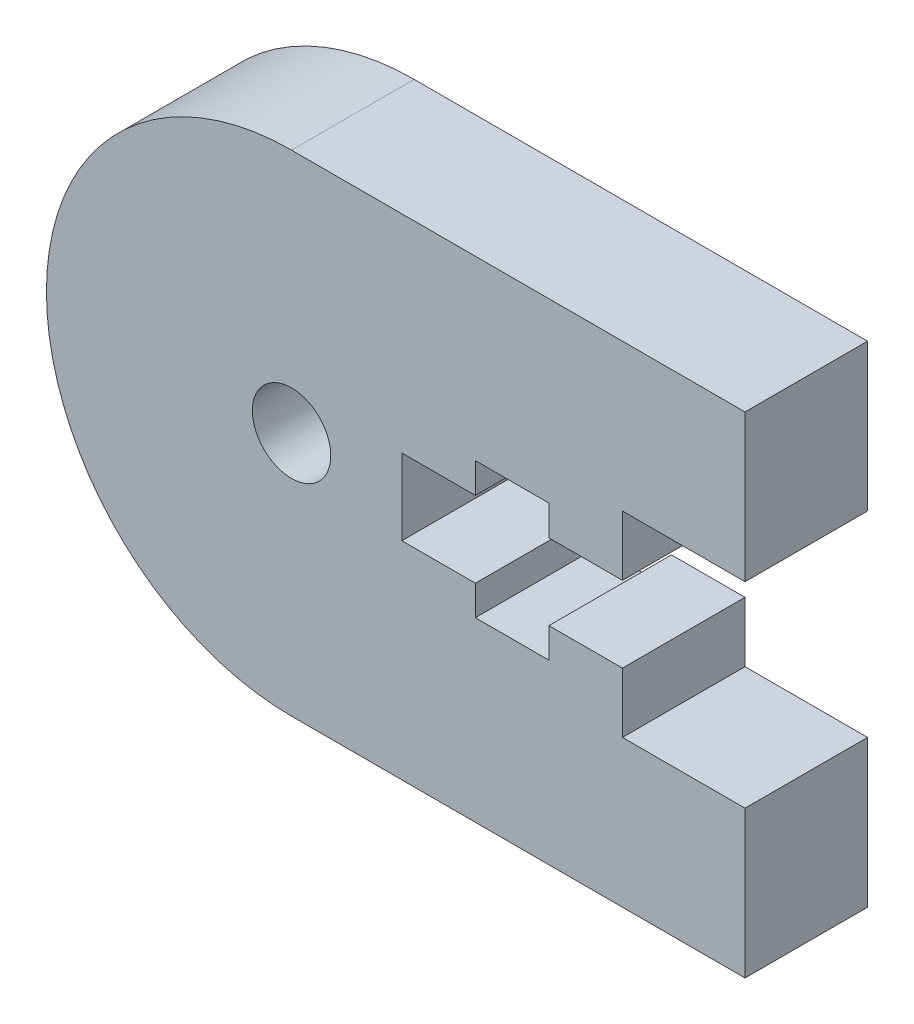
ISO-10303-21;
HEADER;
FILE_DESCRIPTION(('STEP AP214'),'2;1');
FILE_NAME('part.step','',(''),(''),'','','');
FILE_SCHEMA(('AUTOMOTIVE_DESIGN { 1 0 10303 214 1 1 1 1 }'));
ENDSEC;
DATA;
#1=APPLICATION_CONTEXT('core data for automotive mechanical design processes');
#2=APPLICATION_PROTOCOL_DEFINITION('international standard','automotive_design',2000,#1);
#3=PRODUCT_CONTEXT('',#1,'mechanical');
#4=PRODUCT('Part','Part','',(#3));
#5=PRODUCT_RELATED_PRODUCT_CATEGORY('part','',(#4));
#6=PRODUCT_DEFINITION_FORMATION('','',#4);
#7=PRODUCT_DEFINITION_CONTEXT('part definition',#1,'design');
#8=PRODUCT_DEFINITION('design','',#6,#7);
#9=PRODUCT_DEFINITION_SHAPE('','',#8);
#10=(LENGTH_UNIT() NAMED_UNIT(*) SI_UNIT(.MILLI.,.METRE.));
#11=(NAMED_UNIT(*) PLANE_ANGLE_UNIT() SI_UNIT($,.RADIAN.));
#12=(NAMED_UNIT(*) SI_UNIT($,.STERADIAN.) SOLID_ANGLE_UNIT());
#13=UNCERTAINTY_MEASURE_WITH_UNIT(LENGTH_MEASURE(1.E-05),#10,'distance_accuracy_value','');
#14=(GEOMETRIC_REPRESENTATION_CONTEXT(3) GLOBAL_UNCERTAINTY_ASSIGNED_CONTEXT((#13)) GLOBAL_UNIT_ASSIGNED_CONTEXT((#10,
#11,#12)) REPRESENTATION_CONTEXT('',''));
#15=CARTESIAN_POINT('',(0.,0.,0.));
#16=DIRECTION('',(0.,0.,1.));
#17=DIRECTION('',(1.,0.,0.));
#18=AXIS2_PLACEMENT_3D('',#15,#16,#17);
#19=CARTESIAN_POINT('',(12.,4.,0.));
#20=DIRECTION('',(-1.,0.,0.));
#21=DIRECTION('',(0.,0.,1.));
#22=AXIS2_PLACEMENT_3D('',#19,#20,#21);
#23=PLANE('',#22);
#24=DIRECTION('',(0.,0.,1.));
#25=VECTOR('',#24,1.);
#26=CARTESIAN_POINT('',(12.,-1.55,0.));
#27=LINE('',#26,#25);
#28=CARTESIAN_POINT('',(12.,-1.55,0.));
#29=VERTEX_POINT('',#28);
#30=CARTESIAN_POINT('',(12.,-1.55,5.));
#31=VERTEX_POINT('',#30);
#32=EDGE_CURVE('E302',#29,#31,#27,.T.);
#33=ORIENTED_EDGE('',*,*,#32,.T.);
#34=DIRECTION('',(0.,-1.,0.));
#35=VECTOR('',#34,1.);
#36=CARTESIAN_POINT('',(12.,4.,5.));
#37=LINE('',#36,#35);
#38=CARTESIAN_POINT('',(12.,-4.,5.));
#39=VERTEX_POINT('',#38);
#40=EDGE_CURVE('E335',#31,#39,#37,.T.);
#41=ORIENTED_EDGE('',*,*,#40,.T.);
#42=DIRECTION('',(0.,0.,1.));
#43=VECTOR('',#42,1.);
#44=CARTESIAN_POINT('',(12.,-4.,0.));
#45=LINE('',#44,#43);
#46=CARTESIAN_POINT('',(12.,-4.,0.));
#47=VERTEX_POINT('',#46);
#48=EDGE_CURVE('E339',#47,#39,#45,.T.);
#49=ORIENTED_EDGE('',*,*,#48,.F.);
#50=DIRECTION('',(0.,-1.,0.));
#51=VECTOR('',#50,1.);
#52=CARTESIAN_POINT('',(12.,4.,0.));
#53=LINE('',#52,#51);
#54=EDGE_CURVE('E325',#29,#47,#53,.T.);
#55=ORIENTED_EDGE('',*,*,#54,.F.);
#56=EDGE_LOOP('',(#33,#41,#49,#55));
#57=FACE_BOUND('',#56,.T.);
#58=ADVANCED_FACE('F42',(#57),#23,.F.);
#59=CARTESIAN_POINT('',(17.,10.,5.));
#60=DIRECTION('',(1.,0.,0.));
#61=DIRECTION('',(0.,0.,-1.));
#62=AXIS2_PLACEMENT_3D('',#59,#60,#61);
#63=PLANE('',#62);
#64=DIRECTION('',(0.,0.,1.));
#65=VECTOR('',#64,1.);
#66=CARTESIAN_POINT('',(17.,-4.,0.));
#67=LINE('',#66,#65);
#68=CARTESIAN_POINT('',(17.,-4.,0.));
#69=VERTEX_POINT('',#68);
#70=CARTESIAN_POINT('',(17.,-4.,5.));
#71=VERTEX_POINT('',#70);
#72=EDGE_CURVE('E328',#69,#71,#67,.T.);
#73=ORIENTED_EDGE('',*,*,#72,.T.);
#74=DIRECTION('',(0.,-1.,0.));
#75=VECTOR('',#74,1.);
#76=CARTESIAN_POINT('',(17.,10.,5.));
#77=LINE('',#76,#75);
#78=CARTESIAN_POINT('',(17.,-10.,5.));
#79=VERTEX_POINT('',#78);
#80=EDGE_CURVE('E357',#71,#79,#77,.T.);
#81=ORIENTED_EDGE('',*,*,#80,.T.);
#82=DIRECTION('',(0.,0.,-1.));
#83=VECTOR('',#82,1.);
#84=CARTESIAN_POINT('',(17.,-10.,5.));
#85=LINE('',#84,#83);
#86=CARTESIAN_POINT('',(17.,-10.,0.));
#87=VERTEX_POINT('',#86);
#88=EDGE_CURVE('E392',#79,#87,#85,.T.);
#89=ORIENTED_EDGE('',*,*,#88,.T.);
#90=DIRECTION('',(0.,-1.,0.));
#91=VECTOR('',#90,1.);
#92=CARTESIAN_POINT('',(17.,10.,0.));
#93=LINE('',#92,#91);
#94=EDGE_CURVE('E374',#69,#87,#93,.T.);
#95=ORIENTED_EDGE('',*,*,#94,.F.);
#96=EDGE_LOOP('',(#73,#81,#89,#95));
#97=FACE_BOUND('',#96,.T.);
#98=ADVANCED_FACE('F413',(#97),#63,.T.);
#99=CARTESIAN_POINT('',(-1.49999999999999,10.,5.));
#100=DIRECTION('',(0.,1.,0.));
#101=DIRECTION('',(-1.,0.,0.));
#102=AXIS2_PLACEMENT_3D('',#99,#100,#101);
#103=PLANE('',#102);
#104=DIRECTION('',(1.,0.,0.));
#105=VECTOR('',#104,1.);
#106=CARTESIAN_POINT('',(-1.49999999999999,10.,0.));
#107=LINE('',#106,#105);
#108=CARTESIAN_POINT('',(-1.49999999999999,10.,0.));
#109=VERTEX_POINT('',#108);
#110=CARTESIAN_POINT('',(17.,10.,0.));
#111=VERTEX_POINT('',#110);
#112=EDGE_CURVE('E343',#109,#111,#107,.T.);
#113=ORIENTED_EDGE('',*,*,#112,.F.);
#114=DIRECTION('',(0.,0.,-1.));
#115=VECTOR('',#114,1.);
#116=CARTESIAN_POINT('',(-1.49999999999999,10.,5.));
#117=LINE('',#116,#115);
#118=CARTESIAN_POINT('',(-1.49999999999999,10.,5.));
#119=VERTEX_POINT('',#118);
#120=EDGE_CURVE('E385',#119,#109,#117,.T.);
#121=ORIENTED_EDGE('',*,*,#120,.F.);
#122=DIRECTION('',(1.,0.,0.));
#123=VECTOR('',#122,1.);
#124=CARTESIAN_POINT('',(-1.49999999999999,10.,5.));
#125=LINE('',#124,#123);
#126=CARTESIAN_POINT('',(17.,10.,5.));
#127=VERTEX_POINT('',#126);
#128=EDGE_CURVE('E353',#119,#127,#125,.T.);
#129=ORIENTED_EDGE('',*,*,#128,.T.);
#130=DIRECTION('',(0.,0.,-1.));
#131=VECTOR('',#130,1.);
#132=CARTESIAN_POINT('',(17.,10.,5.));
#133=LINE('',#132,#131);
#134=EDGE_CURVE('E370',#127,#111,#133,.T.);
#135=ORIENTED_EDGE('',*,*,#134,.T.);
#136=EDGE_LOOP('',(#113,#121,#129,#135));
#137=FACE_BOUND('',#136,.T.);
#138=ADVANCED_FACE('F420',(#137),#103,.T.);
#139=CARTESIAN_POINT('',(-1.49999999999999,0.,5.));
#140=DIRECTION('',(0.,0.,-1.));
#141=DIRECTION('',(-1.,0.,0.));
#142=AXIS2_PLACEMENT_3D('',#139,#140,#141);
#143=CYLINDRICAL_SURFACE('',#142,10.);
#144=ORIENTED_EDGE('',*,*,#120,.T.);
#145=CARTESIAN_POINT('',(-1.49999999999999,0.,0.));
#146=DIRECTION('',(0.,0.,-1.));
#147=DIRECTION('',(-1.,0.,0.));
#148=AXIS2_PLACEMENT_3D('',#145,#146,#147);
#149=CIRCLE('',#148,10.);
#150=CARTESIAN_POINT('',(-1.5,-10.,0.));
#151=VERTEX_POINT('',#150);
#152=EDGE_CURVE('E358',#151,#109,#149,.T.);
#153=ORIENTED_EDGE('',*,*,#152,.F.);
#154=DIRECTION('',(0.,0.,-1.));
#155=VECTOR('',#154,1.);
#156=CARTESIAN_POINT('',(-1.5,-10.,5.));
#157=LINE('',#156,#155);
#158=CARTESIAN_POINT('',(-1.5,-10.,5.));
#159=VERTEX_POINT('',#158);
#160=EDGE_CURVE('E389',#159,#151,#157,.T.);
#161=ORIENTED_EDGE('',*,*,#160,.F.);
#162=CARTESIAN_POINT('',(-1.49999999999999,0.,5.));
#163=DIRECTION('',(0.,0.,-1.));
#164=DIRECTION('',(-1.,0.,0.));
#165=AXIS2_PLACEMENT_3D('',#162,#163,#164);
#166=CIRCLE('',#165,10.);
#167=EDGE_CURVE('E367',#159,#119,#166,.T.);
#168=ORIENTED_EDGE('',*,*,#167,.T.);
#169=EDGE_LOOP('',(#144,#153,#161,#168));
#170=FACE_BOUND('',#169,.T.);
#171=ADVANCED_FACE('F457',(#170),#143,.T.);
#172=CARTESIAN_POINT('',(17.,-10.,5.));
#173=DIRECTION('',(0.,-1.,0.));
#174=DIRECTION('',(0.,0.,-1.));
#175=AXIS2_PLACEMENT_3D('',#172,#173,#174);
#176=PLANE('',#175);
#177=DIRECTION('',(-1.,0.,0.));
#178=VECTOR('',#177,1.);
#179=CARTESIAN_POINT('',(17.,-10.,0.));
#180=LINE('',#179,#178);
#181=EDGE_CURVE('E379',#87,#151,#180,.T.);
#182=ORIENTED_EDGE('',*,*,#181,.F.);
#183=ORIENTED_EDGE('',*,*,#88,.F.);
#184=DIRECTION('',(-1.,0.,0.));
#185=VECTOR('',#184,1.);
#186=CARTESIAN_POINT('',(17.,-10.,5.));
#187=LINE('',#186,#185);
#188=EDGE_CURVE('E363',#79,#159,#187,.T.);
#189=ORIENTED_EDGE('',*,*,#188,.T.);
#190=ORIENTED_EDGE('',*,*,#160,.T.);
#191=EDGE_LOOP('',(#182,#183,#189,#190));
#192=FACE_BOUND('',#191,.T.);
#193=ADVANCED_FACE('F464',(#192),#176,.T.);
#194=DIRECTION('',(0.,0.,1.));
#195=VECTOR('',#194,1.);
#196=CARTESIAN_POINT('',(17.,4.,0.));
#197=LINE('',#196,#195);
#198=CARTESIAN_POINT('',(17.,4.,0.));
#199=VERTEX_POINT('',#198);
#200=CARTESIAN_POINT('',(17.,4.,5.));
#201=VERTEX_POINT('',#200);
#202=EDGE_CURVE('E347',#199,#201,#197,.T.);
#203=ORIENTED_EDGE('',*,*,#202,.F.);
#204=EDGE_CURVE('E375',#111,#199,#93,.T.);
#205=ORIENTED_EDGE('',*,*,#204,.F.);
#206=ORIENTED_EDGE('',*,*,#134,.F.);
#207=EDGE_CURVE('E359',#127,#201,#77,.T.);
#208=ORIENTED_EDGE('',*,*,#207,.T.);
#209=EDGE_LOOP('',(#203,#205,#206,#208));
#210=FACE_BOUND('',#209,.T.);
#211=ADVANCED_FACE('F423',(#210),#63,.T.);
#212=CARTESIAN_POINT('',(-1.49999999999999,0.,5.));
#213=DIRECTION('',(0.,0.,-1.));
#214=DIRECTION('',(-1.,0.,0.));
#215=AXIS2_PLACEMENT_3D('',#212,#213,#214);
#216=PLANE('',#215);
#217=DIRECTION('',(0.,1.,0.));
#218=VECTOR('',#217,1.);
#219=CARTESIAN_POINT('',(9.,0.,5.));
#220=LINE('',#219,#218);
#221=CARTESIAN_POINT('',(9.,1.55,5.));
#222=VERTEX_POINT('',#221);
#223=CARTESIAN_POINT('',(9.,2.78,5.));
#224=VERTEX_POINT('',#223);
#225=EDGE_CURVE('E265',#222,#224,#220,.T.);
#226=ORIENTED_EDGE('',*,*,#225,.F.);
#227=DIRECTION('',(-1.,0.,0.));
#228=VECTOR('',#227,1.);
#229=CARTESIAN_POINT('',(0.,1.55,5.));
#230=LINE('',#229,#228);
#231=CARTESIAN_POINT('',(12.,1.55,5.));
#232=VERTEX_POINT('',#231);
#233=EDGE_CURVE('E261',#232,#222,#230,.T.);
#234=ORIENTED_EDGE('',*,*,#233,.F.);
#235=CARTESIAN_POINT('',(12.,4.,5.));
#236=VERTEX_POINT('',#235);
#237=EDGE_CURVE('E321',#236,#232,#37,.T.);
#238=ORIENTED_EDGE('',*,*,#237,.F.);
#239=DIRECTION('',(-1.,0.,0.));
#240=VECTOR('',#239,1.);
#241=CARTESIAN_POINT('',(17.,4.,5.));
#242=LINE('',#241,#240);
#243=EDGE_CURVE('E331',#201,#236,#242,.T.);
#244=ORIENTED_EDGE('',*,*,#243,.F.);
#245=ORIENTED_EDGE('',*,*,#207,.F.);
#246=ORIENTED_EDGE('',*,*,#128,.F.);
#247=ORIENTED_EDGE('',*,*,#167,.F.);
#248=ORIENTED_EDGE('',*,*,#188,.F.);
#249=ORIENTED_EDGE('',*,*,#80,.F.);
#250=DIRECTION('',(1.,0.,0.));
#251=VECTOR('',#250,1.);
#252=CARTESIAN_POINT('',(12.,-4.,5.));
#253=LINE('',#252,#251);
#254=EDGE_CURVE('E283',#39,#71,#253,.T.);
#255=ORIENTED_EDGE('',*,*,#254,.F.);
#256=ORIENTED_EDGE('',*,*,#40,.F.);
#257=DIRECTION('',(-1.,0.,0.));
#258=VECTOR('',#257,1.);
#259=CARTESIAN_POINT('',(0.,-1.55,5.));
#260=LINE('',#259,#258);
#261=CARTESIAN_POINT('',(9.,-1.55,5.));
#262=VERTEX_POINT('',#261);
#263=EDGE_CURVE('E58',#31,#262,#260,.T.);
#264=ORIENTED_EDGE('',*,*,#263,.T.);
#265=DIRECTION('',(0.,1.,0.));
#266=VECTOR('',#265,1.);
#267=CARTESIAN_POINT('',(9.,0.,5.));
#268=LINE('',#267,#266);
#269=CARTESIAN_POINT('',(9.,-2.77,5.));
#270=VERTEX_POINT('',#269);
#271=EDGE_CURVE('E255',#270,#262,#268,.T.);
#272=ORIENTED_EDGE('',*,*,#271,.F.);
#273=DIRECTION('',(1.,0.,0.));
#274=VECTOR('',#273,1.);
#275=CARTESIAN_POINT('',(0.,-2.77,5.));
#276=LINE('',#275,#274);
#277=CARTESIAN_POINT('',(6.,-2.77,5.));
#278=VERTEX_POINT('',#277);
#279=EDGE_CURVE('E251',#278,#270,#276,.T.);
#280=ORIENTED_EDGE('',*,*,#279,.F.);
#281=DIRECTION('',(0.,1.,0.));
#282=VECTOR('',#281,1.);
#283=CARTESIAN_POINT('',(6.,0.,5.));
#284=LINE('',#283,#282);
#285=CARTESIAN_POINT('',(6.,-1.55,5.));
#286=VERTEX_POINT('',#285);
#287=EDGE_CURVE('E247',#278,#286,#284,.T.);
#288=ORIENTED_EDGE('',*,*,#287,.T.);
#289=DIRECTION('',(-1.,0.,0.));
#290=VECTOR('',#289,1.);
#291=CARTESIAN_POINT('',(0.,-1.55,5.));
#292=LINE('',#291,#290);
#293=CARTESIAN_POINT('',(3.,-1.55,5.));
#294=VERTEX_POINT('',#293);
#295=EDGE_CURVE('E200',#286,#294,#292,.T.);
#296=ORIENTED_EDGE('',*,*,#295,.T.);
#297=DIRECTION('',(0.,1.,0.));
#298=VECTOR('',#297,1.);
#299=CARTESIAN_POINT('',(3.,0.,5.));
#300=LINE('',#299,#298);
#301=CARTESIAN_POINT('',(3.,1.55,5.));
#302=VERTEX_POINT('',#301);
#303=EDGE_CURVE('E210',#294,#302,#300,.T.);
#304=ORIENTED_EDGE('',*,*,#303,.T.);
#305=DIRECTION('',(-1.,0.,0.));
#306=VECTOR('',#305,1.);
#307=CARTESIAN_POINT('',(0.,1.55,5.));
#308=LINE('',#307,#306);
#309=CARTESIAN_POINT('',(6.,1.55,5.));
#310=VERTEX_POINT('',#309);
#311=EDGE_CURVE('E215',#310,#302,#308,.T.);
#312=ORIENTED_EDGE('',*,*,#311,.F.);
#313=DIRECTION('',(0.,1.,0.));
#314=VECTOR('',#313,1.);
#315=CARTESIAN_POINT('',(6.,0.,5.));
#316=LINE('',#315,#314);
#317=CARTESIAN_POINT('',(6.,2.78,5.));
#318=VERTEX_POINT('',#317);
#319=EDGE_CURVE('E273',#310,#318,#316,.T.);
#320=ORIENTED_EDGE('',*,*,#319,.T.);
#321=DIRECTION('',(1.,0.,0.));
#322=VECTOR('',#321,1.);
#323=CARTESIAN_POINT('',(0.,2.78,5.));
#324=LINE('',#323,#322);
#325=EDGE_CURVE('E269',#318,#224,#324,.T.);
#326=ORIENTED_EDGE('',*,*,#325,.T.);
#327=EDGE_LOOP('',(#226,#234,#238,#244,#245,#246,#247,#248,#249,#255,#256,#264,#272,#280,#288,
#296,#304,#312,#320,#326));
#328=FACE_BOUND('',#327,.T.);
#329=CARTESIAN_POINT('',(-1.49999999999999,0.,5.));
#330=DIRECTION('',(0.,0.,1.));
#331=DIRECTION('',(1.,0.,0.));
#332=AXIS2_PLACEMENT_3D('',#329,#330,#331);
#333=CIRCLE('',#332,1.6);
#334=CARTESIAN_POINT('',(0.100000000000007,0.,5.));
#335=VERTEX_POINT('',#334);
#336=EDGE_CURVE('E248',#335,#335,#333,.T.);
#337=ORIENTED_EDGE('',*,*,#336,.F.);
#338=EDGE_LOOP('',(#337));
#339=FACE_BOUND('',#338,.T.);
#340=ADVANCED_FACE('F440',(#328,#339),#216,.F.);
#341=CARTESIAN_POINT('',(-1.49999999999999,0.,0.));
#342=DIRECTION('',(0.,0.,-1.));
#343=DIRECTION('',(-1.,0.,0.));
#344=AXIS2_PLACEMENT_3D('',#341,#342,#343);
#345=PLANE('',#344);
#346=CARTESIAN_POINT('',(-1.49999999999999,0.,0.));
#347=DIRECTION('',(0.,0.,-1.));
#348=DIRECTION('',(-1.,0.,0.));
#349=AXIS2_PLACEMENT_3D('',#346,#347,#348);
#350=CIRCLE('',#349,3.6);
#351=CARTESIAN_POINT('',(-5.09999999999999,0.,0.));
#352=VERTEX_POINT('',#351);
#353=EDGE_CURVE('E51',#352,#352,#350,.F.);
#354=ORIENTED_EDGE('',*,*,#353,.T.);
#355=EDGE_LOOP('',(#354));
#356=FACE_BOUND('',#355,.T.);
#357=DIRECTION('',(-1.,0.,0.));
#358=VECTOR('',#357,1.);
#359=CARTESIAN_POINT('',(0.,1.55,0.));
#360=LINE('',#359,#358);
#361=CARTESIAN_POINT('',(12.,1.55,0.));
#362=VERTEX_POINT('',#361);
#363=CARTESIAN_POINT('',(9.,1.55,0.));
#364=VERTEX_POINT('',#363);
#365=EDGE_CURVE('E227',#362,#364,#360,.T.);
#366=ORIENTED_EDGE('',*,*,#365,.T.);
#367=DIRECTION('',(0.,1.,0.));
#368=VECTOR('',#367,1.);
#369=CARTESIAN_POINT('',(9.,0.,0.));
#370=LINE('',#369,#368);
#371=CARTESIAN_POINT('',(9.,2.78,0.));
#372=VERTEX_POINT('',#371);
#373=EDGE_CURVE('E230',#364,#372,#370,.T.);
#374=ORIENTED_EDGE('',*,*,#373,.T.);
#375=DIRECTION('',(1.,0.,0.));
#376=VECTOR('',#375,1.);
#377=CARTESIAN_POINT('',(0.,2.78,0.));
#378=LINE('',#377,#376);
#379=CARTESIAN_POINT('',(6.,2.78,0.));
#380=VERTEX_POINT('',#379);
#381=EDGE_CURVE('E234',#380,#372,#378,.T.);
#382=ORIENTED_EDGE('',*,*,#381,.F.);
#383=DIRECTION('',(0.,1.,0.));
#384=VECTOR('',#383,1.);
#385=CARTESIAN_POINT('',(6.,0.,0.));
#386=LINE('',#385,#384);
#387=CARTESIAN_POINT('',(6.,1.55,0.));
#388=VERTEX_POINT('',#387);
#389=EDGE_CURVE('E237',#388,#380,#386,.T.);
#390=ORIENTED_EDGE('',*,*,#389,.F.);
#391=DIRECTION('',(-1.,0.,0.));
#392=VECTOR('',#391,1.);
#393=CARTESIAN_POINT('',(0.,1.55,0.));
#394=LINE('',#393,#392);
#395=CARTESIAN_POINT('',(3.,1.55,0.));
#396=VERTEX_POINT('',#395);
#397=EDGE_CURVE('E240',#388,#396,#394,.T.);
#398=ORIENTED_EDGE('',*,*,#397,.T.);
#399=DIRECTION('',(0.,1.,0.));
#400=VECTOR('',#399,1.);
#401=CARTESIAN_POINT('',(3.,0.,0.));
#402=LINE('',#401,#400);
#403=CARTESIAN_POINT('',(3.,-1.55,0.));
#404=VERTEX_POINT('',#403);
#405=EDGE_CURVE('E203',#404,#396,#402,.T.);
#406=ORIENTED_EDGE('',*,*,#405,.F.);
#407=DIRECTION('',(-1.,0.,0.));
#408=VECTOR('',#407,1.);
#409=CARTESIAN_POINT('',(0.,-1.55,0.));
#410=LINE('',#409,#408);
#411=CARTESIAN_POINT('',(6.,-1.55,0.));
#412=VERTEX_POINT('',#411);
#413=EDGE_CURVE('E193',#412,#404,#410,.T.);
#414=ORIENTED_EDGE('',*,*,#413,.F.);
#415=DIRECTION('',(0.,1.,0.));
#416=VECTOR('',#415,1.);
#417=CARTESIAN_POINT('',(6.,0.,0.));
#418=LINE('',#417,#416);
#419=CARTESIAN_POINT('',(6.,-2.77,0.));
#420=VERTEX_POINT('',#419);
#421=EDGE_CURVE('E180',#420,#412,#418,.T.);
#422=ORIENTED_EDGE('',*,*,#421,.F.);
#423=DIRECTION('',(1.,0.,0.));
#424=VECTOR('',#423,1.);
#425=CARTESIAN_POINT('',(0.,-2.77,0.));
#426=LINE('',#425,#424);
#427=CARTESIAN_POINT('',(9.,-2.77,0.));
#428=VERTEX_POINT('',#427);
#429=EDGE_CURVE('E192',#420,#428,#426,.T.);
#430=ORIENTED_EDGE('',*,*,#429,.T.);
#431=DIRECTION('',(0.,1.,0.));
#432=VECTOR('',#431,1.);
#433=CARTESIAN_POINT('',(9.,0.,0.));
#434=LINE('',#433,#432);
#435=CARTESIAN_POINT('',(9.,-1.55,0.));
#436=VERTEX_POINT('',#435);
#437=EDGE_CURVE('E220',#428,#436,#434,.T.);
#438=ORIENTED_EDGE('',*,*,#437,.T.);
#439=DIRECTION('',(-1.,0.,0.));
#440=VECTOR('',#439,1.);
#441=CARTESIAN_POINT('',(0.,-1.55,0.));
#442=LINE('',#441,#440);
#443=EDGE_CURVE('E224',#29,#436,#442,.T.);
#444=ORIENTED_EDGE('',*,*,#443,.F.);
#445=ORIENTED_EDGE('',*,*,#54,.T.);
#446=DIRECTION('',(1.,0.,0.));
#447=VECTOR('',#446,1.);
#448=CARTESIAN_POINT('',(12.,-4.,0.));
#449=LINE('',#448,#447);
#450=EDGE_CURVE('E316',#47,#69,#449,.T.);
#451=ORIENTED_EDGE('',*,*,#450,.T.);
#452=ORIENTED_EDGE('',*,*,#94,.T.);
#453=ORIENTED_EDGE('',*,*,#181,.T.);
#454=ORIENTED_EDGE('',*,*,#152,.T.);
#455=ORIENTED_EDGE('',*,*,#112,.T.);
#456=ORIENTED_EDGE('',*,*,#204,.T.);
#457=DIRECTION('',(-1.,0.,0.));
#458=VECTOR('',#457,1.);
#459=CARTESIAN_POINT('',(17.,4.,0.));
#460=LINE('',#459,#458);
#461=CARTESIAN_POINT('',(12.,4.,0.));
#462=VERTEX_POINT('',#461);
#463=EDGE_CURVE('E320',#199,#462,#460,.T.);
#464=ORIENTED_EDGE('',*,*,#463,.T.);
#465=EDGE_CURVE('E66',#462,#362,#53,.T.);
#466=ORIENTED_EDGE('',*,*,#465,.T.);
#467=EDGE_LOOP('',(#366,#374,#382,#390,#398,#406,#414,#422,#430,#438,#444,#445,#451,#452,#453,
#454,#455,#456,#464,#466));
#468=FACE_BOUND('',#467,.T.);
#469=ADVANCED_FACE('F207',(#356,#468),#345,.T.);
#470=CARTESIAN_POINT('',(12.,-4.,0.));
#471=DIRECTION('',(0.,-1.,0.));
#472=DIRECTION('',(0.,0.,-1.));
#473=AXIS2_PLACEMENT_3D('',#470,#471,#472);
#474=PLANE('',#473);
#475=ORIENTED_EDGE('',*,*,#254,.T.);
#476=ORIENTED_EDGE('',*,*,#72,.F.);
#477=ORIENTED_EDGE('',*,*,#450,.F.);
#478=ORIENTED_EDGE('',*,*,#48,.T.);
#479=EDGE_LOOP('',(#475,#476,#477,#478));
#480=FACE_BOUND('',#479,.T.);
#481=ADVANCED_FACE('F427',(#480),#474,.F.);
#482=ORIENTED_EDGE('',*,*,#237,.T.);
#483=DIRECTION('',(0.,0.,1.));
#484=VECTOR('',#483,1.);
#485=CARTESIAN_POINT('',(12.,1.55,0.));
#486=LINE('',#485,#484);
#487=EDGE_CURVE('E299',#362,#232,#486,.T.);
#488=ORIENTED_EDGE('',*,*,#487,.F.);
#489=ORIENTED_EDGE('',*,*,#465,.F.);
#490=DIRECTION('',(0.,0.,1.));
#491=VECTOR('',#490,1.);
#492=CARTESIAN_POINT('',(12.,4.,0.));
#493=LINE('',#492,#491);
#494=EDGE_CURVE('E344',#462,#236,#493,.T.);
#495=ORIENTED_EDGE('',*,*,#494,.T.);
#496=EDGE_LOOP('',(#482,#488,#489,#495));
#497=FACE_BOUND('',#496,.T.);
#498=ADVANCED_FACE('F416',(#497),#23,.F.);
#499=CARTESIAN_POINT('',(17.,4.,0.));
#500=DIRECTION('',(0.,1.,0.));
#501=DIRECTION('',(0.,0.,1.));
#502=AXIS2_PLACEMENT_3D('',#499,#500,#501);
#503=PLANE('',#502);
#504=ORIENTED_EDGE('',*,*,#243,.T.);
#505=ORIENTED_EDGE('',*,*,#494,.F.);
#506=ORIENTED_EDGE('',*,*,#463,.F.);
#507=ORIENTED_EDGE('',*,*,#202,.T.);
#508=EDGE_LOOP('',(#504,#505,#506,#507));
#509=FACE_BOUND('',#508,.T.);
#510=ADVANCED_FACE('F426',(#509),#503,.F.);
#511=CARTESIAN_POINT('',(0.,-1.55,0.));
#512=DIRECTION('',(0.,1.,0.));
#513=DIRECTION('',(-1.,0.,0.));
#514=AXIS2_PLACEMENT_3D('',#511,#512,#513);
#515=PLANE('',#514);
#516=ORIENTED_EDGE('',*,*,#295,.F.);
#517=DIRECTION('',(0.,0.,1.));
#518=VECTOR('',#517,1.);
#519=CARTESIAN_POINT('',(6.,-1.55,0.));
#520=LINE('',#519,#518);
#521=EDGE_CURVE('E184',#412,#286,#520,.T.);
#522=ORIENTED_EDGE('',*,*,#521,.F.);
#523=ORIENTED_EDGE('',*,*,#413,.T.);
#524=DIRECTION('',(0.,0.,1.));
#525=VECTOR('',#524,1.);
#526=CARTESIAN_POINT('',(3.,-1.55,0.));
#527=LINE('',#526,#525);
#528=EDGE_CURVE('E280',#404,#294,#527,.T.);
#529=ORIENTED_EDGE('',*,*,#528,.T.);
#530=EDGE_LOOP('',(#516,#522,#523,#529));
#531=FACE_BOUND('',#530,.T.);
#532=ADVANCED_FACE('F196',(#531),#515,.T.);
#533=CARTESIAN_POINT('',(3.,0.,0.));
#534=DIRECTION('',(1.,0.,0.));
#535=DIRECTION('',(0.,0.,-1.));
#536=AXIS2_PLACEMENT_3D('',#533,#534,#535);
#537=PLANE('',#536);
#538=ORIENTED_EDGE('',*,*,#303,.F.);
#539=ORIENTED_EDGE('',*,*,#528,.F.);
#540=ORIENTED_EDGE('',*,*,#405,.T.);
#541=DIRECTION('',(0.,0.,1.));
#542=VECTOR('',#541,1.);
#543=CARTESIAN_POINT('',(3.,1.55,0.));
#544=LINE('',#543,#542);
#545=EDGE_CURVE('E284',#396,#302,#544,.T.);
#546=ORIENTED_EDGE('',*,*,#545,.T.);
#547=EDGE_LOOP('',(#538,#539,#540,#546));
#548=FACE_BOUND('',#547,.T.);
#549=ADVANCED_FACE('F537',(#548),#537,.T.);
#550=CARTESIAN_POINT('',(0.,1.55,0.));
#551=DIRECTION('',(0.,1.,0.));
#552=DIRECTION('',(-1.,0.,0.));
#553=AXIS2_PLACEMENT_3D('',#550,#551,#552);
#554=PLANE('',#553);
#555=ORIENTED_EDGE('',*,*,#311,.T.);
#556=ORIENTED_EDGE('',*,*,#545,.F.);
#557=ORIENTED_EDGE('',*,*,#397,.F.);
#558=DIRECTION('',(0.,0.,1.));
#559=VECTOR('',#558,1.);
#560=CARTESIAN_POINT('',(6.,1.55,0.));
#561=LINE('',#560,#559);
#562=EDGE_CURVE('E287',#388,#310,#561,.T.);
#563=ORIENTED_EDGE('',*,*,#562,.T.);
#564=EDGE_LOOP('',(#555,#556,#557,#563));
#565=FACE_BOUND('',#564,.T.);
#566=ADVANCED_FACE('F541',(#565),#554,.F.);
#567=CARTESIAN_POINT('',(6.,0.,0.));
#568=DIRECTION('',(1.,0.,0.));
#569=DIRECTION('',(0.,0.,-1.));
#570=AXIS2_PLACEMENT_3D('',#567,#568,#569);
#571=PLANE('',#570);
#572=ORIENTED_EDGE('',*,*,#319,.F.);
#573=ORIENTED_EDGE('',*,*,#562,.F.);
#574=ORIENTED_EDGE('',*,*,#389,.T.);
#575=DIRECTION('',(0.,0.,1.));
#576=VECTOR('',#575,1.);
#577=CARTESIAN_POINT('',(6.,2.78,0.));
#578=LINE('',#577,#576);
#579=EDGE_CURVE('E290',#380,#318,#578,.T.);
#580=ORIENTED_EDGE('',*,*,#579,.T.);
#581=EDGE_LOOP('',(#572,#573,#574,#580));
#582=FACE_BOUND('',#581,.T.);
#583=ADVANCED_FACE('F547',(#582),#571,.T.);
#584=CARTESIAN_POINT('',(0.,2.78,0.));
#585=DIRECTION('',(0.,-1.,0.));
#586=DIRECTION('',(1.,0.,0.));
#587=AXIS2_PLACEMENT_3D('',#584,#585,#586);
#588=PLANE('',#587);
#589=ORIENTED_EDGE('',*,*,#325,.F.);
#590=ORIENTED_EDGE('',*,*,#579,.F.);
#591=ORIENTED_EDGE('',*,*,#381,.T.);
#592=DIRECTION('',(0.,0.,1.));
#593=VECTOR('',#592,1.);
#594=CARTESIAN_POINT('',(9.,2.78,0.));
#595=LINE('',#594,#593);
#596=EDGE_CURVE('E293',#372,#224,#595,.T.);
#597=ORIENTED_EDGE('',*,*,#596,.T.);
#598=EDGE_LOOP('',(#589,#590,#591,#597));
#599=FACE_BOUND('',#598,.T.);
#600=ADVANCED_FACE('F553',(#599),#588,.T.);
#601=CARTESIAN_POINT('',(9.,0.,0.));
#602=DIRECTION('',(1.,0.,0.));
#603=DIRECTION('',(0.,0.,-1.));
#604=AXIS2_PLACEMENT_3D('',#601,#602,#603);
#605=PLANE('',#604);
#606=ORIENTED_EDGE('',*,*,#225,.T.);
#607=ORIENTED_EDGE('',*,*,#596,.F.);
#608=ORIENTED_EDGE('',*,*,#373,.F.);
#609=DIRECTION('',(0.,0.,1.));
#610=VECTOR('',#609,1.);
#611=CARTESIAN_POINT('',(9.,1.55,0.));
#612=LINE('',#611,#610);
#613=EDGE_CURVE('E296',#364,#222,#612,.T.);
#614=ORIENTED_EDGE('',*,*,#613,.T.);
#615=EDGE_LOOP('',(#606,#607,#608,#614));
#616=FACE_BOUND('',#615,.T.);
#617=ADVANCED_FACE('F557',(#616),#605,.F.);
#618=CARTESIAN_POINT('',(0.,1.55,0.));
#619=DIRECTION('',(0.,1.,0.));
#620=DIRECTION('',(-1.,0.,0.));
#621=AXIS2_PLACEMENT_3D('',#618,#619,#620);
#622=PLANE('',#621);
#623=ORIENTED_EDGE('',*,*,#233,.T.);
#624=ORIENTED_EDGE('',*,*,#613,.F.);
#625=ORIENTED_EDGE('',*,*,#365,.F.);
#626=ORIENTED_EDGE('',*,*,#487,.T.);
#627=EDGE_LOOP('',(#623,#624,#625,#626));
#628=FACE_BOUND('',#627,.T.);
#629=ADVANCED_FACE('F444',(#628),#622,.F.);
#630=CARTESIAN_POINT('',(0.,-1.55,0.));
#631=DIRECTION('',(0.,1.,0.));
#632=DIRECTION('',(-1.,0.,0.));
#633=AXIS2_PLACEMENT_3D('',#630,#631,#632);
#634=PLANE('',#633);
#635=ORIENTED_EDGE('',*,*,#263,.F.);
#636=ORIENTED_EDGE('',*,*,#32,.F.);
#637=ORIENTED_EDGE('',*,*,#443,.T.);
#638=DIRECTION('',(0.,0.,1.));
#639=VECTOR('',#638,1.);
#640=CARTESIAN_POINT('',(9.,-1.55,0.));
#641=LINE('',#640,#639);
#642=EDGE_CURVE('E305',#436,#262,#641,.T.);
#643=ORIENTED_EDGE('',*,*,#642,.T.);
#644=EDGE_LOOP('',(#635,#636,#637,#643));
#645=FACE_BOUND('',#644,.T.);
#646=ADVANCED_FACE('F519',(#645),#634,.T.);
#647=CARTESIAN_POINT('',(9.,0.,0.));
#648=DIRECTION('',(1.,0.,0.));
#649=DIRECTION('',(0.,0.,-1.));
#650=AXIS2_PLACEMENT_3D('',#647,#648,#649);
#651=PLANE('',#650);
#652=ORIENTED_EDGE('',*,*,#271,.T.);
#653=ORIENTED_EDGE('',*,*,#642,.F.);
#654=ORIENTED_EDGE('',*,*,#437,.F.);
#655=DIRECTION('',(0.,0.,1.));
#656=VECTOR('',#655,1.);
#657=CARTESIAN_POINT('',(9.,-2.77,0.));
#658=LINE('',#657,#656);
#659=EDGE_CURVE('E308',#428,#270,#658,.T.);
#660=ORIENTED_EDGE('',*,*,#659,.T.);
#661=EDGE_LOOP('',(#652,#653,#654,#660));
#662=FACE_BOUND('',#661,.T.);
#663=ADVANCED_FACE('F521',(#662),#651,.F.);
#664=CARTESIAN_POINT('',(0.,-2.77,0.));
#665=DIRECTION('',(0.,-1.,0.));
#666=DIRECTION('',(0.,0.,-1.));
#667=AXIS2_PLACEMENT_3D('',#664,#665,#666);
#668=PLANE('',#667);
#669=ORIENTED_EDGE('',*,*,#279,.T.);
#670=ORIENTED_EDGE('',*,*,#659,.F.);
#671=ORIENTED_EDGE('',*,*,#429,.F.);
#672=DIRECTION('',(0.,0.,1.));
#673=VECTOR('',#672,1.);
#674=CARTESIAN_POINT('',(6.,-2.77,0.));
#675=LINE('',#674,#673);
#676=EDGE_CURVE('E186',#420,#278,#675,.T.);
#677=ORIENTED_EDGE('',*,*,#676,.T.);
#678=EDGE_LOOP('',(#669,#670,#671,#677));
#679=FACE_BOUND('',#678,.T.);
#680=ADVANCED_FACE('F525',(#679),#668,.F.);
#681=CARTESIAN_POINT('',(6.,0.,0.));
#682=DIRECTION('',(1.,0.,0.));
#683=DIRECTION('',(0.,0.,-1.));
#684=AXIS2_PLACEMENT_3D('',#681,#682,#683);
#685=PLANE('',#684);
#686=ORIENTED_EDGE('',*,*,#287,.F.);
#687=ORIENTED_EDGE('',*,*,#676,.F.);
#688=ORIENTED_EDGE('',*,*,#421,.T.);
#689=ORIENTED_EDGE('',*,*,#521,.T.);
#690=EDGE_LOOP('',(#686,#687,#688,#689));
#691=FACE_BOUND('',#690,.T.);
#692=ADVANCED_FACE('F183',(#691),#685,.T.);
#693=CARTESIAN_POINT('',(-1.49999999999999,0.,0.));
#694=DIRECTION('',(0.,0.,1.));
#695=DIRECTION('',(1.,0.,0.));
#696=AXIS2_PLACEMENT_3D('',#693,#694,#695);
#697=CYLINDRICAL_SURFACE('',#696,1.6);
#698=CARTESIAN_POINT('',(-1.49999999999999,0.,2.));
#699=DIRECTION('',(0.,0.,-1.));
#700=DIRECTION('',(-1.,0.,0.));
#701=AXIS2_PLACEMENT_3D('',#698,#699,#700);
#702=CIRCLE('',#701,1.6);
#703=CARTESIAN_POINT('',(-3.09999999999999,0.,2.));
#704=VERTEX_POINT('',#703);
#705=EDGE_CURVE('E11',#704,#704,#702,.T.);
#706=ORIENTED_EDGE('',*,*,#705,.T.);
#707=EDGE_LOOP('',(#706));
#708=FACE_BOUND('',#707,.T.);
#709=ORIENTED_EDGE('',*,*,#336,.T.);
#710=EDGE_LOOP('',(#709));
#711=FACE_BOUND('',#710,.T.);
#712=ADVANCED_FACE('F404',(#708,#711),#697,.F.);
#713=CARTESIAN_POINT('',(-1.49999999999999,0.,0.));
#714=DIRECTION('',(0.,0.,-1.));
#715=DIRECTION('',(-1.,0.,0.));
#716=AXIS2_PLACEMENT_3D('',#713,#714,#715);
#717=CONICAL_SURFACE('',#716,3.6,0.785398163397447);
#718=ORIENTED_EDGE('',*,*,#705,.F.);
#719=EDGE_LOOP('',(#718));
#720=FACE_BOUND('',#719,.T.);
#721=ORIENTED_EDGE('',*,*,#353,.F.);
#722=EDGE_LOOP('',(#721));
#723=FACE_BOUND('',#722,.T.);
#724=ADVANCED_FACE('F44',(#720,#723),#717,.F.);
#725=CLOSED_SHELL('',(#58,#98,#138,#171,#193,#211,#340,#469,#481,#498,#510,#532,#549,#566,#583,
#600,#617,#629,#646,#663,#680,#692,#712,#724));
#726=MANIFOLD_SOLID_BREP('B2',#725);
#727=ADVANCED_BREP_SHAPE_REPRESENTATION('',(#18,#726),#14);
#728=SHAPE_DEFINITION_REPRESENTATION(#9,#727);
ENDSEC;
END-ISO-10303-21;
